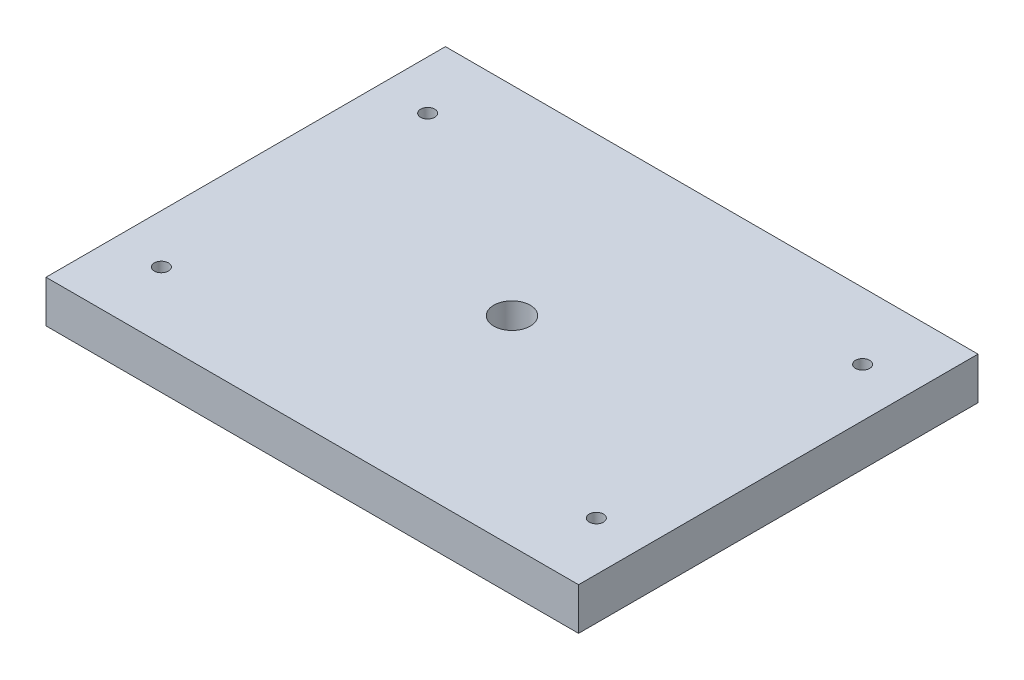
ISO-10303-21;
HEADER;
FILE_DESCRIPTION(('STEP AP214'),'2;1');
FILE_NAME('part.step','',(''),(''),'','','');
FILE_SCHEMA(('AUTOMOTIVE_DESIGN { 1 0 10303 214 1 1 1 1 }'));
ENDSEC;
DATA;
#1=APPLICATION_CONTEXT('core data for automotive mechanical design processes');
#2=APPLICATION_PROTOCOL_DEFINITION('international standard','automotive_design',2000,#1);
#3=PRODUCT_CONTEXT('',#1,'mechanical');
#4=PRODUCT('Part','Part','',(#3));
#5=PRODUCT_RELATED_PRODUCT_CATEGORY('part','',(#4));
#6=PRODUCT_DEFINITION_FORMATION('','',#4);
#7=PRODUCT_DEFINITION_CONTEXT('part definition',#1,'design');
#8=PRODUCT_DEFINITION('design','',#6,#7);
#9=PRODUCT_DEFINITION_SHAPE('','',#8);
#10=(LENGTH_UNIT() NAMED_UNIT(*) SI_UNIT(.MILLI.,.METRE.));
#11=(NAMED_UNIT(*) PLANE_ANGLE_UNIT() SI_UNIT($,.RADIAN.));
#12=(NAMED_UNIT(*) SI_UNIT($,.STERADIAN.) SOLID_ANGLE_UNIT());
#13=UNCERTAINTY_MEASURE_WITH_UNIT(LENGTH_MEASURE(1.E-05),#10,'distance_accuracy_value','');
#14=(GEOMETRIC_REPRESENTATION_CONTEXT(3) GLOBAL_UNCERTAINTY_ASSIGNED_CONTEXT((#13)) GLOBAL_UNIT_ASSIGNED_CONTEXT((#10,
#11,#12)) REPRESENTATION_CONTEXT('',''));
#15=CARTESIAN_POINT('',(0.,0.,0.));
#16=DIRECTION('',(0.,0.,1.));
#17=DIRECTION('',(1.,0.,0.));
#18=AXIS2_PLACEMENT_3D('',#15,#16,#17);
#19=CARTESIAN_POINT('',(60.,9.5,45.));
#20=DIRECTION('',(-1.,0.,0.));
#21=DIRECTION('',(0.,0.,1.));
#22=AXIS2_PLACEMENT_3D('',#19,#20,#21);
#23=PLANE('',#22);
#24=DIRECTION('',(0.,0.,-1.));
#25=VECTOR('',#24,1.);
#26=CARTESIAN_POINT('',(60.,0.,45.));
#27=LINE('',#26,#25);
#28=CARTESIAN_POINT('',(60.,0.,45.));
#29=VERTEX_POINT('',#28);
#30=CARTESIAN_POINT('',(60.,0.,-45.));
#31=VERTEX_POINT('',#30);
#32=EDGE_CURVE('E96',#29,#31,#27,.T.);
#33=ORIENTED_EDGE('',*,*,#32,.T.);
#34=DIRECTION('',(0.,-1.,0.));
#35=VECTOR('',#34,1.);
#36=CARTESIAN_POINT('',(60.,9.5,-45.));
#37=LINE('',#36,#35);
#38=CARTESIAN_POINT('',(60.,9.5,-45.));
#39=VERTEX_POINT('',#38);
#40=EDGE_CURVE('E11',#39,#31,#37,.T.);
#41=ORIENTED_EDGE('',*,*,#40,.F.);
#42=DIRECTION('',(0.,0.,-1.));
#43=VECTOR('',#42,1.);
#44=CARTESIAN_POINT('',(60.,9.5,45.));
#45=LINE('',#44,#43);
#46=CARTESIAN_POINT('',(60.,9.5,45.));
#47=VERTEX_POINT('',#46);
#48=EDGE_CURVE('E84',#47,#39,#45,.T.);
#49=ORIENTED_EDGE('',*,*,#48,.F.);
#50=DIRECTION('',(0.,-1.,0.));
#51=VECTOR('',#50,1.);
#52=CARTESIAN_POINT('',(60.,9.5,45.));
#53=LINE('',#52,#51);
#54=EDGE_CURVE('E92',#47,#29,#53,.T.);
#55=ORIENTED_EDGE('',*,*,#54,.T.);
#56=EDGE_LOOP('',(#33,#41,#49,#55));
#57=FACE_BOUND('',#56,.T.);
#58=ADVANCED_FACE('F33',(#57),#23,.F.);
#59=CARTESIAN_POINT('',(-60.,9.5,-45.));
#60=DIRECTION('',(0.,0.,1.));
#61=DIRECTION('',(1.,0.,0.));
#62=AXIS2_PLACEMENT_3D('',#59,#60,#61);
#63=PLANE('',#62);
#64=DIRECTION('',(-1.,0.,0.));
#65=VECTOR('',#64,1.);
#66=CARTESIAN_POINT('',(-60.,0.,-45.));
#67=LINE('',#66,#65);
#68=CARTESIAN_POINT('',(-60.,0.,-45.));
#69=VERTEX_POINT('',#68);
#70=EDGE_CURVE('E88',#31,#69,#67,.T.);
#71=ORIENTED_EDGE('',*,*,#70,.T.);
#72=DIRECTION('',(0.,-1.,0.));
#73=VECTOR('',#72,1.);
#74=CARTESIAN_POINT('',(-60.,9.5,-45.));
#75=LINE('',#74,#73);
#76=CARTESIAN_POINT('',(-60.,9.5,-45.));
#77=VERTEX_POINT('',#76);
#78=EDGE_CURVE('E41',#77,#69,#75,.T.);
#79=ORIENTED_EDGE('',*,*,#78,.F.);
#80=DIRECTION('',(-1.,0.,0.));
#81=VECTOR('',#80,1.);
#82=CARTESIAN_POINT('',(-60.,9.5,-45.));
#83=LINE('',#82,#81);
#84=EDGE_CURVE('E79',#39,#77,#83,.T.);
#85=ORIENTED_EDGE('',*,*,#84,.F.);
#86=ORIENTED_EDGE('',*,*,#40,.T.);
#87=EDGE_LOOP('',(#71,#79,#85,#86));
#88=FACE_BOUND('',#87,.T.);
#89=ADVANCED_FACE('F87',(#88),#63,.F.);
#90=CARTESIAN_POINT('',(-60.,9.5,45.));
#91=DIRECTION('',(1.,0.,0.));
#92=DIRECTION('',(0.,0.,-1.));
#93=AXIS2_PLACEMENT_3D('',#90,#91,#92);
#94=PLANE('',#93);
#95=DIRECTION('',(0.,0.,1.));
#96=VECTOR('',#95,1.);
#97=CARTESIAN_POINT('',(-60.,0.,45.));
#98=LINE('',#97,#96);
#99=CARTESIAN_POINT('',(-60.,0.,45.));
#100=VERTEX_POINT('',#99);
#101=EDGE_CURVE('E66',#69,#100,#98,.T.);
#102=ORIENTED_EDGE('',*,*,#101,.T.);
#103=DIRECTION('',(0.,-1.,0.));
#104=VECTOR('',#103,1.);
#105=CARTESIAN_POINT('',(-60.,9.5,45.));
#106=LINE('',#105,#104);
#107=CARTESIAN_POINT('',(-60.,9.5,45.));
#108=VERTEX_POINT('',#107);
#109=EDGE_CURVE('E89',#108,#100,#106,.T.);
#110=ORIENTED_EDGE('',*,*,#109,.F.);
#111=DIRECTION('',(0.,0.,1.));
#112=VECTOR('',#111,1.);
#113=CARTESIAN_POINT('',(-60.,9.5,45.));
#114=LINE('',#113,#112);
#115=EDGE_CURVE('E82',#77,#108,#114,.T.);
#116=ORIENTED_EDGE('',*,*,#115,.F.);
#117=ORIENTED_EDGE('',*,*,#78,.T.);
#118=EDGE_LOOP('',(#102,#110,#116,#117));
#119=FACE_BOUND('',#118,.T.);
#120=ADVANCED_FACE('F90',(#119),#94,.F.);
#121=CARTESIAN_POINT('',(-60.,9.5,45.));
#122=DIRECTION('',(0.,0.,-1.));
#123=DIRECTION('',(-1.,0.,0.));
#124=AXIS2_PLACEMENT_3D('',#121,#122,#123);
#125=PLANE('',#124);
#126=DIRECTION('',(1.,0.,0.));
#127=VECTOR('',#126,1.);
#128=CARTESIAN_POINT('',(-60.,0.,45.));
#129=LINE('',#128,#127);
#130=EDGE_CURVE('E72',#100,#29,#129,.T.);
#131=ORIENTED_EDGE('',*,*,#130,.T.);
#132=ORIENTED_EDGE('',*,*,#54,.F.);
#133=DIRECTION('',(1.,0.,0.));
#134=VECTOR('',#133,1.);
#135=CARTESIAN_POINT('',(-60.,9.5,45.));
#136=LINE('',#135,#134);
#137=EDGE_CURVE('E49',#108,#47,#136,.T.);
#138=ORIENTED_EDGE('',*,*,#137,.F.);
#139=ORIENTED_EDGE('',*,*,#109,.T.);
#140=EDGE_LOOP('',(#131,#132,#138,#139));
#141=FACE_BOUND('',#140,.T.);
#142=ADVANCED_FACE('F104',(#141),#125,.F.);
#143=CARTESIAN_POINT('',(0.,9.5,0.));
#144=DIRECTION('',(0.,-1.,0.));
#145=DIRECTION('',(0.,0.,-1.));
#146=AXIS2_PLACEMENT_3D('',#143,#144,#145);
#147=PLANE('',#146);
#148=CARTESIAN_POINT('',(0.,9.5,0.));
#149=DIRECTION('',(0.,1.,0.));
#150=DIRECTION('',(0.,0.,1.));
#151=AXIS2_PLACEMENT_3D('',#148,#149,#150);
#152=CIRCLE('',#151,4.1);
#153=CARTESIAN_POINT('',(0.,9.5,4.1));
#154=VERTEX_POINT('',#153);
#155=EDGE_CURVE('E134',#154,#154,#152,.T.);
#156=ORIENTED_EDGE('',*,*,#155,.F.);
#157=EDGE_LOOP('',(#156));
#158=FACE_BOUND('',#157,.T.);
#159=CARTESIAN_POINT('',(-49.,9.5,-30.));
#160=DIRECTION('',(0.,1.,0.));
#161=DIRECTION('',(0.,0.,-1.));
#162=AXIS2_PLACEMENT_3D('',#159,#160,#161);
#163=CIRCLE('',#162,1.6);
#164=CARTESIAN_POINT('',(-49.,9.5,-31.6));
#165=VERTEX_POINT('',#164);
#166=EDGE_CURVE('E128',#165,#165,#163,.T.);
#167=ORIENTED_EDGE('',*,*,#166,.F.);
#168=EDGE_LOOP('',(#167));
#169=FACE_BOUND('',#168,.T.);
#170=CARTESIAN_POINT('',(49.,9.5,-30.));
#171=DIRECTION('',(0.,1.,0.));
#172=DIRECTION('',(0.,0.,1.));
#173=AXIS2_PLACEMENT_3D('',#170,#171,#172);
#174=CIRCLE('',#173,1.6);
#175=CARTESIAN_POINT('',(49.,9.5,-28.4));
#176=VERTEX_POINT('',#175);
#177=EDGE_CURVE('E122',#176,#176,#174,.T.);
#178=ORIENTED_EDGE('',*,*,#177,.F.);
#179=EDGE_LOOP('',(#178));
#180=FACE_BOUND('',#179,.T.);
#181=CARTESIAN_POINT('',(49.,9.5,30.));
#182=DIRECTION('',(0.,1.,0.));
#183=DIRECTION('',(0.,0.,-1.));
#184=AXIS2_PLACEMENT_3D('',#181,#182,#183);
#185=CIRCLE('',#184,1.6);
#186=CARTESIAN_POINT('',(49.,9.5,28.4));
#187=VERTEX_POINT('',#186);
#188=EDGE_CURVE('E116',#187,#187,#185,.T.);
#189=ORIENTED_EDGE('',*,*,#188,.F.);
#190=EDGE_LOOP('',(#189));
#191=FACE_BOUND('',#190,.T.);
#192=CARTESIAN_POINT('',(-49.,9.5,30.));
#193=DIRECTION('',(0.,1.,0.));
#194=DIRECTION('',(0.,0.,1.));
#195=AXIS2_PLACEMENT_3D('',#192,#193,#194);
#196=CIRCLE('',#195,1.6);
#197=CARTESIAN_POINT('',(-49.,9.5,31.6));
#198=VERTEX_POINT('',#197);
#199=EDGE_CURVE('E110',#198,#198,#196,.T.);
#200=ORIENTED_EDGE('',*,*,#199,.F.);
#201=EDGE_LOOP('',(#200));
#202=FACE_BOUND('',#201,.T.);
#203=ORIENTED_EDGE('',*,*,#48,.T.);
#204=ORIENTED_EDGE('',*,*,#84,.T.);
#205=ORIENTED_EDGE('',*,*,#115,.T.);
#206=ORIENTED_EDGE('',*,*,#137,.T.);
#207=EDGE_LOOP('',(#203,#204,#205,#206));
#208=FACE_BOUND('',#207,.T.);
#209=ADVANCED_FACE('F80',(#158,#169,#180,#191,#202,#208),#147,.F.);
#210=CARTESIAN_POINT('',(0.,0.,0.));
#211=DIRECTION('',(0.,-1.,0.));
#212=DIRECTION('',(0.,0.,-1.));
#213=AXIS2_PLACEMENT_3D('',#210,#211,#212);
#214=PLANE('',#213);
#215=CARTESIAN_POINT('',(0.,0.,0.));
#216=DIRECTION('',(0.,1.,0.));
#217=DIRECTION('',(0.,0.,1.));
#218=AXIS2_PLACEMENT_3D('',#215,#216,#217);
#219=CIRCLE('',#218,4.1);
#220=CARTESIAN_POINT('',(0.,0.,4.1));
#221=VERTEX_POINT('',#220);
#222=EDGE_CURVE('E131',#221,#221,#219,.T.);
#223=ORIENTED_EDGE('',*,*,#222,.T.);
#224=EDGE_LOOP('',(#223));
#225=FACE_BOUND('',#224,.T.);
#226=CARTESIAN_POINT('',(-49.,0.,-30.));
#227=DIRECTION('',(0.,1.,0.));
#228=DIRECTION('',(0.,0.,-1.));
#229=AXIS2_PLACEMENT_3D('',#226,#227,#228);
#230=CIRCLE('',#229,1.6);
#231=CARTESIAN_POINT('',(-49.,0.,-31.6));
#232=VERTEX_POINT('',#231);
#233=EDGE_CURVE('E125',#232,#232,#230,.T.);
#234=ORIENTED_EDGE('',*,*,#233,.T.);
#235=EDGE_LOOP('',(#234));
#236=FACE_BOUND('',#235,.T.);
#237=CARTESIAN_POINT('',(49.,0.,-30.));
#238=DIRECTION('',(0.,1.,0.));
#239=DIRECTION('',(0.,0.,1.));
#240=AXIS2_PLACEMENT_3D('',#237,#238,#239);
#241=CIRCLE('',#240,1.6);
#242=CARTESIAN_POINT('',(49.,0.,-28.4));
#243=VERTEX_POINT('',#242);
#244=EDGE_CURVE('E119',#243,#243,#241,.T.);
#245=ORIENTED_EDGE('',*,*,#244,.T.);
#246=EDGE_LOOP('',(#245));
#247=FACE_BOUND('',#246,.T.);
#248=CARTESIAN_POINT('',(49.,0.,30.));
#249=DIRECTION('',(0.,1.,0.));
#250=DIRECTION('',(0.,0.,-1.));
#251=AXIS2_PLACEMENT_3D('',#248,#249,#250);
#252=CIRCLE('',#251,1.6);
#253=CARTESIAN_POINT('',(49.,0.,28.4));
#254=VERTEX_POINT('',#253);
#255=EDGE_CURVE('E113',#254,#254,#252,.T.);
#256=ORIENTED_EDGE('',*,*,#255,.T.);
#257=EDGE_LOOP('',(#256));
#258=FACE_BOUND('',#257,.T.);
#259=CARTESIAN_POINT('',(-49.,0.,30.));
#260=DIRECTION('',(0.,1.,0.));
#261=DIRECTION('',(0.,0.,1.));
#262=AXIS2_PLACEMENT_3D('',#259,#260,#261);
#263=CIRCLE('',#262,1.6);
#264=CARTESIAN_POINT('',(-49.,0.,31.6));
#265=VERTEX_POINT('',#264);
#266=EDGE_CURVE('E99',#265,#265,#263,.T.);
#267=ORIENTED_EDGE('',*,*,#266,.T.);
#268=EDGE_LOOP('',(#267));
#269=FACE_BOUND('',#268,.T.);
#270=ORIENTED_EDGE('',*,*,#32,.F.);
#271=ORIENTED_EDGE('',*,*,#130,.F.);
#272=ORIENTED_EDGE('',*,*,#101,.F.);
#273=ORIENTED_EDGE('',*,*,#70,.F.);
#274=EDGE_LOOP('',(#270,#271,#272,#273));
#275=FACE_BOUND('',#274,.T.);
#276=ADVANCED_FACE('F107',(#225,#236,#247,#258,#269,#275),#214,.T.);
#277=CARTESIAN_POINT('',(-49.,0.,30.));
#278=DIRECTION('',(0.,1.,0.));
#279=DIRECTION('',(0.,0.,1.));
#280=AXIS2_PLACEMENT_3D('',#277,#278,#279);
#281=CYLINDRICAL_SURFACE('',#280,1.6);
#282=ORIENTED_EDGE('',*,*,#266,.F.);
#283=EDGE_LOOP('',(#282));
#284=FACE_BOUND('',#283,.T.);
#285=ORIENTED_EDGE('',*,*,#199,.T.);
#286=EDGE_LOOP('',(#285));
#287=FACE_BOUND('',#286,.T.);
#288=ADVANCED_FACE('F160',(#284,#287),#281,.F.);
#289=CARTESIAN_POINT('',(49.,0.,30.));
#290=DIRECTION('',(0.,1.,0.));
#291=DIRECTION('',(0.,0.,1.));
#292=AXIS2_PLACEMENT_3D('',#289,#290,#291);
#293=CYLINDRICAL_SURFACE('',#292,1.6);
#294=ORIENTED_EDGE('',*,*,#255,.F.);
#295=EDGE_LOOP('',(#294));
#296=FACE_BOUND('',#295,.T.);
#297=ORIENTED_EDGE('',*,*,#188,.T.);
#298=EDGE_LOOP('',(#297));
#299=FACE_BOUND('',#298,.T.);
#300=ADVANCED_FACE('F162',(#296,#299),#293,.F.);
#301=CARTESIAN_POINT('',(49.,0.,-30.));
#302=DIRECTION('',(0.,1.,0.));
#303=DIRECTION('',(0.,0.,1.));
#304=AXIS2_PLACEMENT_3D('',#301,#302,#303);
#305=CYLINDRICAL_SURFACE('',#304,1.6);
#306=ORIENTED_EDGE('',*,*,#244,.F.);
#307=EDGE_LOOP('',(#306));
#308=FACE_BOUND('',#307,.T.);
#309=ORIENTED_EDGE('',*,*,#177,.T.);
#310=EDGE_LOOP('',(#309));
#311=FACE_BOUND('',#310,.T.);
#312=ADVANCED_FACE('F169',(#308,#311),#305,.F.);
#313=CARTESIAN_POINT('',(-49.,0.,-30.));
#314=DIRECTION('',(0.,1.,0.));
#315=DIRECTION('',(0.,0.,1.));
#316=AXIS2_PLACEMENT_3D('',#313,#314,#315);
#317=CYLINDRICAL_SURFACE('',#316,1.6);
#318=ORIENTED_EDGE('',*,*,#233,.F.);
#319=EDGE_LOOP('',(#318));
#320=FACE_BOUND('',#319,.T.);
#321=ORIENTED_EDGE('',*,*,#166,.T.);
#322=EDGE_LOOP('',(#321));
#323=FACE_BOUND('',#322,.T.);
#324=ADVANCED_FACE('F145',(#320,#323),#317,.F.);
#325=CARTESIAN_POINT('',(0.,0.,0.));
#326=DIRECTION('',(0.,1.,0.));
#327=DIRECTION('',(0.,0.,1.));
#328=AXIS2_PLACEMENT_3D('',#325,#326,#327);
#329=CYLINDRICAL_SURFACE('',#328,4.1);
#330=ORIENTED_EDGE('',*,*,#222,.F.);
#331=EDGE_LOOP('',(#330));
#332=FACE_BOUND('',#331,.T.);
#333=ORIENTED_EDGE('',*,*,#155,.T.);
#334=EDGE_LOOP('',(#333));
#335=FACE_BOUND('',#334,.T.);
#336=ADVANCED_FACE('F142',(#332,#335),#329,.F.);
#337=CLOSED_SHELL('',(#58,#89,#120,#142,#209,#276,#288,#300,#312,#324,#336));
#338=MANIFOLD_SOLID_BREP('B2',#337);
#339=ADVANCED_BREP_SHAPE_REPRESENTATION('',(#18,#338),#14);
#340=SHAPE_DEFINITION_REPRESENTATION(#9,#339);
ENDSEC;
END-ISO-10303-21;
